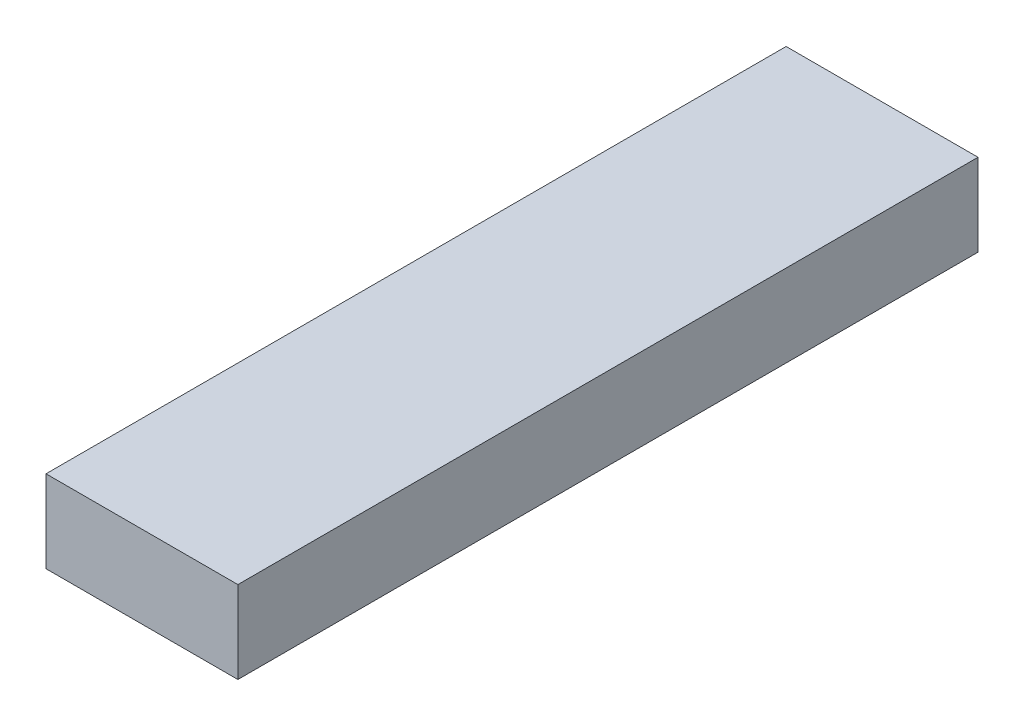
ISO-10303-21;
HEADER;
FILE_DESCRIPTION(('STEP AP214'),'2;1');
FILE_NAME('part.step','',(''),(''),'','','');
FILE_SCHEMA(('AUTOMOTIVE_DESIGN { 1 0 10303 214 1 1 1 1 }'));
ENDSEC;
DATA;
#1=APPLICATION_CONTEXT('core data for automotive mechanical design processes');
#2=APPLICATION_PROTOCOL_DEFINITION('international standard','automotive_design',2000,#1);
#3=PRODUCT_CONTEXT('',#1,'mechanical');
#4=PRODUCT('Part','Part','',(#3));
#5=PRODUCT_RELATED_PRODUCT_CATEGORY('part','',(#4));
#6=PRODUCT_DEFINITION_FORMATION('','',#4);
#7=PRODUCT_DEFINITION_CONTEXT('part definition',#1,'design');
#8=PRODUCT_DEFINITION('design','',#6,#7);
#9=PRODUCT_DEFINITION_SHAPE('','',#8);
#10=(LENGTH_UNIT() NAMED_UNIT(*) SI_UNIT(.MILLI.,.METRE.));
#11=(NAMED_UNIT(*) PLANE_ANGLE_UNIT() SI_UNIT($,.RADIAN.));
#12=(NAMED_UNIT(*) SI_UNIT($,.STERADIAN.) SOLID_ANGLE_UNIT());
#13=UNCERTAINTY_MEASURE_WITH_UNIT(LENGTH_MEASURE(1.E-05),#10,'distance_accuracy_value','');
#14=(GEOMETRIC_REPRESENTATION_CONTEXT(3) GLOBAL_UNCERTAINTY_ASSIGNED_CONTEXT((#13)) GLOBAL_UNIT_ASSIGNED_CONTEXT((#10,
#11,#12)) REPRESENTATION_CONTEXT('',''));
#15=CARTESIAN_POINT('',(0.,0.,0.));
#16=DIRECTION('',(0.,0.,1.));
#17=DIRECTION('',(1.,0.,0.));
#18=AXIS2_PLACEMENT_3D('',#15,#16,#17);
#19=CARTESIAN_POINT('',(0.,38.1,0.));
#20=DIRECTION('',(1.,0.,0.));
#21=DIRECTION('',(0.,0.,-1.));
#22=AXIS2_PLACEMENT_3D('',#19,#20,#21);
#23=PLANE('',#22);
#24=DIRECTION('',(0.,0.,1.));
#25=VECTOR('',#24,1.);
#26=CARTESIAN_POINT('',(0.,0.,0.));
#27=LINE('',#26,#25);
#28=CARTESIAN_POINT('',(0.,0.,-342.9));
#29=VERTEX_POINT('',#28);
#30=CARTESIAN_POINT('',(0.,0.,0.));
#31=VERTEX_POINT('',#30);
#32=EDGE_CURVE('E96',#29,#31,#27,.T.);
#33=ORIENTED_EDGE('',*,*,#32,.T.);
#34=DIRECTION('',(0.,-1.,0.));
#35=VECTOR('',#34,1.);
#36=CARTESIAN_POINT('',(0.,38.1,0.));
#37=LINE('',#36,#35);
#38=CARTESIAN_POINT('',(0.,38.1,0.));
#39=VERTEX_POINT('',#38);
#40=EDGE_CURVE('E11',#39,#31,#37,.T.);
#41=ORIENTED_EDGE('',*,*,#40,.F.);
#42=DIRECTION('',(0.,0.,1.));
#43=VECTOR('',#42,1.);
#44=CARTESIAN_POINT('',(0.,38.1,0.));
#45=LINE('',#44,#43);
#46=CARTESIAN_POINT('',(0.,38.1,-342.9));
#47=VERTEX_POINT('',#46);
#48=EDGE_CURVE('E84',#47,#39,#45,.T.);
#49=ORIENTED_EDGE('',*,*,#48,.F.);
#50=DIRECTION('',(0.,-1.,0.));
#51=VECTOR('',#50,1.);
#52=CARTESIAN_POINT('',(0.,38.1,-342.9));
#53=LINE('',#52,#51);
#54=EDGE_CURVE('E92',#47,#29,#53,.T.);
#55=ORIENTED_EDGE('',*,*,#54,.T.);
#56=EDGE_LOOP('',(#33,#41,#49,#55));
#57=FACE_BOUND('',#56,.T.);
#58=ADVANCED_FACE('F33',(#57),#23,.F.);
#59=CARTESIAN_POINT('',(0.,38.1,0.));
#60=DIRECTION('',(0.,0.,-1.));
#61=DIRECTION('',(-1.,0.,0.));
#62=AXIS2_PLACEMENT_3D('',#59,#60,#61);
#63=PLANE('',#62);
#64=DIRECTION('',(1.,0.,0.));
#65=VECTOR('',#64,1.);
#66=CARTESIAN_POINT('',(0.,0.,0.));
#67=LINE('',#66,#65);
#68=CARTESIAN_POINT('',(88.9,0.,0.));
#69=VERTEX_POINT('',#68);
#70=EDGE_CURVE('E88',#31,#69,#67,.T.);
#71=ORIENTED_EDGE('',*,*,#70,.T.);
#72=DIRECTION('',(0.,-1.,0.));
#73=VECTOR('',#72,1.);
#74=CARTESIAN_POINT('',(88.9,38.1,0.));
#75=LINE('',#74,#73);
#76=CARTESIAN_POINT('',(88.9,38.1,0.));
#77=VERTEX_POINT('',#76);
#78=EDGE_CURVE('E41',#77,#69,#75,.T.);
#79=ORIENTED_EDGE('',*,*,#78,.F.);
#80=DIRECTION('',(1.,0.,0.));
#81=VECTOR('',#80,1.);
#82=CARTESIAN_POINT('',(0.,38.1,0.));
#83=LINE('',#82,#81);
#84=EDGE_CURVE('E79',#39,#77,#83,.T.);
#85=ORIENTED_EDGE('',*,*,#84,.F.);
#86=ORIENTED_EDGE('',*,*,#40,.T.);
#87=EDGE_LOOP('',(#71,#79,#85,#86));
#88=FACE_BOUND('',#87,.T.);
#89=ADVANCED_FACE('F87',(#88),#63,.F.);
#90=CARTESIAN_POINT('',(88.9,38.1,0.));
#91=DIRECTION('',(-1.,0.,0.));
#92=DIRECTION('',(0.,0.,1.));
#93=AXIS2_PLACEMENT_3D('',#90,#91,#92);
#94=PLANE('',#93);
#95=DIRECTION('',(0.,0.,-1.));
#96=VECTOR('',#95,1.);
#97=CARTESIAN_POINT('',(88.9,0.,0.));
#98=LINE('',#97,#96);
#99=CARTESIAN_POINT('',(88.9,0.,-342.9));
#100=VERTEX_POINT('',#99);
#101=EDGE_CURVE('E66',#69,#100,#98,.T.);
#102=ORIENTED_EDGE('',*,*,#101,.T.);
#103=DIRECTION('',(0.,-1.,0.));
#104=VECTOR('',#103,1.);
#105=CARTESIAN_POINT('',(88.9,38.1,-342.9));
#106=LINE('',#105,#104);
#107=CARTESIAN_POINT('',(88.9,38.1,-342.9));
#108=VERTEX_POINT('',#107);
#109=EDGE_CURVE('E89',#108,#100,#106,.T.);
#110=ORIENTED_EDGE('',*,*,#109,.F.);
#111=DIRECTION('',(0.,0.,-1.));
#112=VECTOR('',#111,1.);
#113=CARTESIAN_POINT('',(88.9,38.1,0.));
#114=LINE('',#113,#112);
#115=EDGE_CURVE('E82',#77,#108,#114,.T.);
#116=ORIENTED_EDGE('',*,*,#115,.F.);
#117=ORIENTED_EDGE('',*,*,#78,.T.);
#118=EDGE_LOOP('',(#102,#110,#116,#117));
#119=FACE_BOUND('',#118,.T.);
#120=ADVANCED_FACE('F90',(#119),#94,.F.);
#121=CARTESIAN_POINT('',(0.,38.1,-342.9));
#122=DIRECTION('',(0.,0.,1.));
#123=DIRECTION('',(1.,0.,0.));
#124=AXIS2_PLACEMENT_3D('',#121,#122,#123);
#125=PLANE('',#124);
#126=DIRECTION('',(-1.,0.,0.));
#127=VECTOR('',#126,1.);
#128=CARTESIAN_POINT('',(0.,0.,-342.9));
#129=LINE('',#128,#127);
#130=EDGE_CURVE('E72',#100,#29,#129,.T.);
#131=ORIENTED_EDGE('',*,*,#130,.T.);
#132=ORIENTED_EDGE('',*,*,#54,.F.);
#133=DIRECTION('',(-1.,0.,0.));
#134=VECTOR('',#133,1.);
#135=CARTESIAN_POINT('',(0.,38.1,-342.9));
#136=LINE('',#135,#134);
#137=EDGE_CURVE('E49',#108,#47,#136,.T.);
#138=ORIENTED_EDGE('',*,*,#137,.F.);
#139=ORIENTED_EDGE('',*,*,#109,.T.);
#140=EDGE_LOOP('',(#131,#132,#138,#139));
#141=FACE_BOUND('',#140,.T.);
#142=ADVANCED_FACE('F103',(#141),#125,.F.);
#143=CARTESIAN_POINT('',(0.,38.1,0.));
#144=DIRECTION('',(0.,-1.,0.));
#145=DIRECTION('',(0.,0.,-1.));
#146=AXIS2_PLACEMENT_3D('',#143,#144,#145);
#147=PLANE('',#146);
#148=ORIENTED_EDGE('',*,*,#48,.T.);
#149=ORIENTED_EDGE('',*,*,#84,.T.);
#150=ORIENTED_EDGE('',*,*,#115,.T.);
#151=ORIENTED_EDGE('',*,*,#137,.T.);
#152=EDGE_LOOP('',(#148,#149,#150,#151));
#153=FACE_BOUND('',#152,.T.);
#154=ADVANCED_FACE('F80',(#153),#147,.F.);
#155=CARTESIAN_POINT('',(0.,0.,0.));
#156=DIRECTION('',(0.,-1.,0.));
#157=DIRECTION('',(0.,0.,-1.));
#158=AXIS2_PLACEMENT_3D('',#155,#156,#157);
#159=PLANE('',#158);
#160=ORIENTED_EDGE('',*,*,#32,.F.);
#161=ORIENTED_EDGE('',*,*,#130,.F.);
#162=ORIENTED_EDGE('',*,*,#101,.F.);
#163=ORIENTED_EDGE('',*,*,#70,.F.);
#164=EDGE_LOOP('',(#160,#161,#162,#163));
#165=FACE_BOUND('',#164,.T.);
#166=ADVANCED_FACE('F106',(#165),#159,.T.);
#167=CLOSED_SHELL('',(#58,#89,#120,#142,#154,#166));
#168=MANIFOLD_SOLID_BREP('B2',#167);
#169=ADVANCED_BREP_SHAPE_REPRESENTATION('',(#18,#168),#14);
#170=SHAPE_DEFINITION_REPRESENTATION(#9,#169);
ENDSEC;
END-ISO-10303-21;
